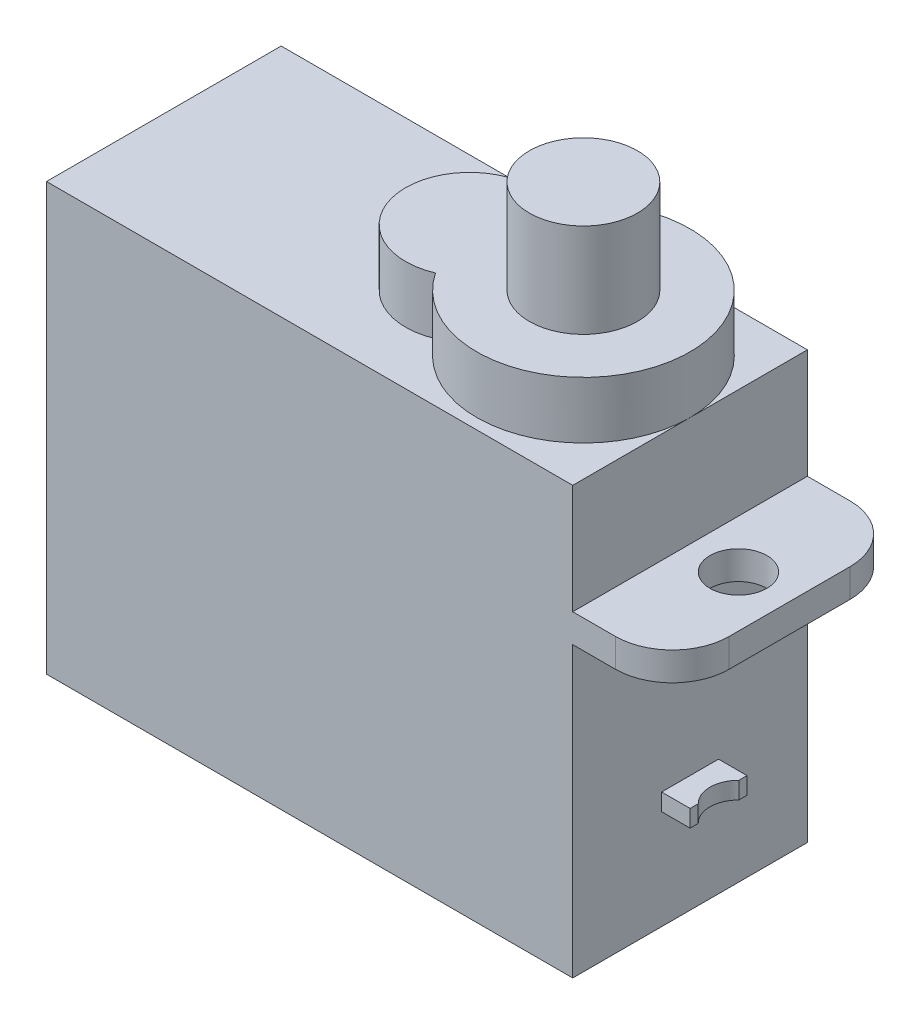
ISO-10303-21;
HEADER;
FILE_DESCRIPTION(('STEP AP214'),'2;1');
FILE_NAME('part.step','',(''),(''),'','','');
FILE_SCHEMA(('AUTOMOTIVE_DESIGN { 1 0 10303 214 1 1 1 1 }'));
ENDSEC;
DATA;
#1=APPLICATION_CONTEXT('core data for automotive mechanical design processes');
#2=APPLICATION_PROTOCOL_DEFINITION('international standard','automotive_design',2000,#1);
#3=PRODUCT_CONTEXT('',#1,'mechanical');
#4=PRODUCT('Part','Part','',(#3));
#5=PRODUCT_RELATED_PRODUCT_CATEGORY('part','',(#4));
#6=PRODUCT_DEFINITION_FORMATION('','',#4);
#7=PRODUCT_DEFINITION_CONTEXT('part definition',#1,'design');
#8=PRODUCT_DEFINITION('design','',#6,#7);
#9=PRODUCT_DEFINITION_SHAPE('','',#8);
#10=(LENGTH_UNIT() NAMED_UNIT(*) SI_UNIT(.MILLI.,.METRE.));
#11=(NAMED_UNIT(*) PLANE_ANGLE_UNIT() SI_UNIT($,.RADIAN.));
#12=(NAMED_UNIT(*) SI_UNIT($,.STERADIAN.) SOLID_ANGLE_UNIT());
#13=UNCERTAINTY_MEASURE_WITH_UNIT(LENGTH_MEASURE(1.E-05),#10,'distance_accuracy_value','');
#14=(GEOMETRIC_REPRESENTATION_CONTEXT(3) GLOBAL_UNCERTAINTY_ASSIGNED_CONTEXT((#13)) GLOBAL_UNIT_ASSIGNED_CONTEXT((#10,
#11,#12)) REPRESENTATION_CONTEXT('',''));
#15=CARTESIAN_POINT('',(0.,0.,0.));
#16=DIRECTION('',(0.,0.,1.));
#17=DIRECTION('',(1.,0.,0.));
#18=AXIS2_PLACEMENT_3D('',#15,#16,#17);
#19=CARTESIAN_POINT('',(10.25,0.,0.));
#20=DIRECTION('',(1.,0.,0.));
#21=DIRECTION('',(0.,0.,-1.));
#22=AXIS2_PLACEMENT_3D('',#19,#20,#21);
#23=PLANE('',#22);
#24=DIRECTION('',(0.,1.,0.));
#25=VECTOR('',#24,1.);
#26=CARTESIAN_POINT('',(10.25,0.,-0.714142842854284));
#27=LINE('',#26,#25);
#28=CARTESIAN_POINT('',(10.25,3.5,-0.714142842854284));
#29=VERTEX_POINT('',#28);
#30=CARTESIAN_POINT('',(10.25,4.1,-0.714142842854284));
#31=VERTEX_POINT('',#30);
#32=EDGE_CURVE('E190',#29,#31,#27,.T.);
#33=ORIENTED_EDGE('',*,*,#32,.F.);
#34=DIRECTION('',(0.,0.,-1.));
#35=VECTOR('',#34,1.);
#36=CARTESIAN_POINT('',(10.25,3.5,-1.));
#37=LINE('',#36,#35);
#38=CARTESIAN_POINT('',(10.25,3.5,-1.));
#39=VERTEX_POINT('',#38);
#40=EDGE_CURVE('E188',#29,#39,#37,.T.);
#41=ORIENTED_EDGE('',*,*,#40,.T.);
#42=DIRECTION('',(0.,1.,0.));
#43=VECTOR('',#42,1.);
#44=CARTESIAN_POINT('',(10.25,3.5,-1.));
#45=LINE('',#44,#43);
#46=CARTESIAN_POINT('',(10.25,4.1,-1.));
#47=VERTEX_POINT('',#46);
#48=EDGE_CURVE('E197',#39,#47,#45,.T.);
#49=ORIENTED_EDGE('',*,*,#48,.T.);
#50=DIRECTION('',(0.,0.,1.));
#51=VECTOR('',#50,1.);
#52=CARTESIAN_POINT('',(10.25,4.1,-1.));
#53=LINE('',#52,#51);
#54=EDGE_CURVE('E206',#47,#31,#53,.T.);
#55=ORIENTED_EDGE('',*,*,#54,.T.);
#56=EDGE_LOOP('',(#33,#41,#49,#55));
#57=FACE_BOUND('',#56,.T.);
#58=ADVANCED_FACE('F38',(#57),#23,.T.);
#59=CARTESIAN_POINT('',(9.25,15.,4.125));
#60=DIRECTION('',(-1.,0.,0.));
#61=DIRECTION('',(0.,0.,1.));
#62=AXIS2_PLACEMENT_3D('',#59,#60,#61);
#63=PLANE('',#62);
#64=DIRECTION('',(0.,-1.,0.));
#65=VECTOR('',#64,1.);
#66=CARTESIAN_POINT('',(9.25,3.5,1.));
#67=LINE('',#66,#65);
#68=CARTESIAN_POINT('',(9.25,4.1,1.));
#69=VERTEX_POINT('',#68);
#70=CARTESIAN_POINT('',(9.25,3.5,1.));
#71=VERTEX_POINT('',#70);
#72=EDGE_CURVE('E211',#69,#71,#67,.T.);
#73=ORIENTED_EDGE('',*,*,#72,.F.);
#74=DIRECTION('',(0.,0.,1.));
#75=VECTOR('',#74,1.);
#76=CARTESIAN_POINT('',(9.25,4.1,-1.));
#77=LINE('',#76,#75);
#78=CARTESIAN_POINT('',(9.25,4.1,-1.));
#79=VERTEX_POINT('',#78);
#80=EDGE_CURVE('E224',#79,#69,#77,.T.);
#81=ORIENTED_EDGE('',*,*,#80,.F.);
#82=DIRECTION('',(0.,1.,0.));
#83=VECTOR('',#82,1.);
#84=CARTESIAN_POINT('',(9.25,3.5,-1.));
#85=LINE('',#84,#83);
#86=CARTESIAN_POINT('',(9.25,3.5,-1.));
#87=VERTEX_POINT('',#86);
#88=EDGE_CURVE('E220',#87,#79,#85,.T.);
#89=ORIENTED_EDGE('',*,*,#88,.F.);
#90=DIRECTION('',(0.,0.,-1.));
#91=VECTOR('',#90,1.);
#92=CARTESIAN_POINT('',(9.25,3.5,-1.));
#93=LINE('',#92,#91);
#94=EDGE_CURVE('E215',#71,#87,#93,.T.);
#95=ORIENTED_EDGE('',*,*,#94,.F.);
#96=EDGE_LOOP('',(#73,#81,#89,#95));
#97=FACE_BOUND('',#96,.T.);
#98=DIRECTION('',(0.,0.,-1.));
#99=VECTOR('',#98,1.);
#100=CARTESIAN_POINT('',(9.25,10.15,4.125));
#101=LINE('',#100,#99);
#102=CARTESIAN_POINT('',(9.25,10.15,4.125));
#103=VERTEX_POINT('',#102);
#104=CARTESIAN_POINT('',(9.25,10.15,-4.125));
#105=VERTEX_POINT('',#104);
#106=EDGE_CURVE('E357',#103,#105,#101,.T.);
#107=ORIENTED_EDGE('',*,*,#106,.F.);
#108=DIRECTION('',(0.,-1.,0.));
#109=VECTOR('',#108,1.);
#110=CARTESIAN_POINT('',(9.25,15.,4.125));
#111=LINE('',#110,#109);
#112=CARTESIAN_POINT('',(9.25,0.,4.125));
#113=VERTEX_POINT('',#112);
#114=EDGE_CURVE('E313',#103,#113,#111,.T.);
#115=ORIENTED_EDGE('',*,*,#114,.T.);
#116=DIRECTION('',(0.,0.,-1.));
#117=VECTOR('',#116,1.);
#118=CARTESIAN_POINT('',(9.25,0.,4.125));
#119=LINE('',#118,#117);
#120=CARTESIAN_POINT('',(9.25,0.,-4.125));
#121=VERTEX_POINT('',#120);
#122=EDGE_CURVE('E299',#113,#121,#119,.T.);
#123=ORIENTED_EDGE('',*,*,#122,.T.);
#124=DIRECTION('',(0.,-1.,0.));
#125=VECTOR('',#124,1.);
#126=CARTESIAN_POINT('',(9.25,15.,-4.125));
#127=LINE('',#126,#125);
#128=EDGE_CURVE('E308',#105,#121,#127,.T.);
#129=ORIENTED_EDGE('',*,*,#128,.F.);
#130=EDGE_LOOP('',(#107,#115,#123,#129));
#131=FACE_BOUND('',#130,.T.);
#132=ADVANCED_FACE('F414',(#97,#131),#63,.F.);
#133=CARTESIAN_POINT('',(9.25,15.,4.125));
#134=VERTEX_POINT('',#133);
#135=CARTESIAN_POINT('',(9.25,11.15,4.125));
#136=VERTEX_POINT('',#135);
#137=EDGE_CURVE('E314',#134,#136,#111,.T.);
#138=ORIENTED_EDGE('',*,*,#137,.T.);
#139=DIRECTION('',(0.,0.,-1.));
#140=VECTOR('',#139,1.);
#141=CARTESIAN_POINT('',(9.25,11.15,4.125));
#142=LINE('',#141,#140);
#143=CARTESIAN_POINT('',(9.25,11.15,-4.125));
#144=VERTEX_POINT('',#143);
#145=EDGE_CURVE('E216',#136,#144,#142,.T.);
#146=ORIENTED_EDGE('',*,*,#145,.T.);
#147=CARTESIAN_POINT('',(9.25,15.,-4.125));
#148=VERTEX_POINT('',#147);
#149=EDGE_CURVE('E309',#148,#144,#127,.T.);
#150=ORIENTED_EDGE('',*,*,#149,.F.);
#151=DIRECTION('',(0.,0.,-1.));
#152=VECTOR('',#151,1.);
#153=CARTESIAN_POINT('',(9.25,15.,4.125));
#154=LINE('',#153,#152);
#155=CARTESIAN_POINT('',(9.24999999999999,15.,0.));
#156=VERTEX_POINT('',#155);
#157=EDGE_CURVE('E283',#156,#148,#154,.T.);
#158=ORIENTED_EDGE('',*,*,#157,.F.);
#159=EDGE_CURVE('E284',#134,#156,#154,.T.);
#160=ORIENTED_EDGE('',*,*,#159,.F.);
#161=EDGE_LOOP('',(#138,#146,#150,#158,#160));
#162=FACE_BOUND('',#161,.T.);
#163=ADVANCED_FACE('F380',(#162),#63,.F.);
#164=CARTESIAN_POINT('',(5.49999999999999,17.,0.));
#165=DIRECTION('',(0.,-1.,0.));
#166=DIRECTION('',(0.,0.,-1.));
#167=AXIS2_PLACEMENT_3D('',#164,#165,#166);
#168=CYLINDRICAL_SURFACE('',#167,3.75);
#169=DIRECTION('',(0.,-1.,0.));
#170=VECTOR('',#169,1.);
#171=CARTESIAN_POINT('',(2.37499999999999,16.,-2.07289049397213));
#172=LINE('',#171,#170);
#173=CARTESIAN_POINT('',(2.37499999999999,17.,-2.07289049397212));
#174=VERTEX_POINT('',#173);
#175=CARTESIAN_POINT('',(2.37499999999999,15.,-2.07289049397212));
#176=VERTEX_POINT('',#175);
#177=EDGE_CURVE('E262',#174,#176,#172,.T.);
#178=ORIENTED_EDGE('',*,*,#177,.F.);
#179=CARTESIAN_POINT('',(5.49999999999999,17.,0.));
#180=DIRECTION('',(0.,1.,0.));
#181=DIRECTION('',(0.,0.,1.));
#182=AXIS2_PLACEMENT_3D('',#179,#180,#181);
#183=CIRCLE('',#182,3.75);
#184=CARTESIAN_POINT('',(2.37499999999999,17.,2.07289049397212));
#185=VERTEX_POINT('',#184);
#186=EDGE_CURVE('E266',#185,#174,#183,.T.);
#187=ORIENTED_EDGE('',*,*,#186,.F.);
#188=DIRECTION('',(0.,-1.,0.));
#189=VECTOR('',#188,1.);
#190=CARTESIAN_POINT('',(2.37499999999999,16.,2.07289049397213));
#191=LINE('',#190,#189);
#192=CARTESIAN_POINT('',(2.37499999999999,15.,2.07289049397212));
#193=VERTEX_POINT('',#192);
#194=EDGE_CURVE('E256',#193,#185,#191,.F.);
#195=ORIENTED_EDGE('',*,*,#194,.F.);
#196=CARTESIAN_POINT('',(5.49999999999999,15.,0.));
#197=DIRECTION('',(0.,1.,0.));
#198=DIRECTION('',(0.,0.,1.));
#199=AXIS2_PLACEMENT_3D('',#196,#197,#198);
#200=CIRCLE('',#199,3.75);
#201=EDGE_CURVE('E265',#193,#156,#200,.T.);
#202=ORIENTED_EDGE('',*,*,#201,.T.);
#203=EDGE_CURVE('E271',#156,#176,#200,.T.);
#204=ORIENTED_EDGE('',*,*,#203,.T.);
#205=EDGE_LOOP('',(#178,#187,#195,#202,#204));
#206=FACE_BOUND('',#205,.T.);
#207=ADVANCED_FACE('F453',(#206),#168,.T.);
#208=CARTESIAN_POINT('',(-9.25,15.,4.125));
#209=DIRECTION('',(1.,0.,0.));
#210=DIRECTION('',(0.,0.,-1.));
#211=AXIS2_PLACEMENT_3D('',#208,#209,#210);
#212=PLANE('',#211);
#213=DIRECTION('',(0.,-1.,0.));
#214=VECTOR('',#213,1.);
#215=CARTESIAN_POINT('',(-9.25,15.,-4.125));
#216=LINE('',#215,#214);
#217=CARTESIAN_POINT('',(-9.25,15.,-4.125));
#218=VERTEX_POINT('',#217);
#219=CARTESIAN_POINT('',(-9.25,0.,-4.125));
#220=VERTEX_POINT('',#219);
#221=EDGE_CURVE('E291',#218,#220,#216,.T.);
#222=ORIENTED_EDGE('',*,*,#221,.T.);
#223=DIRECTION('',(0.,0.,1.));
#224=VECTOR('',#223,1.);
#225=CARTESIAN_POINT('',(-9.25,0.,4.125));
#226=LINE('',#225,#224);
#227=CARTESIAN_POINT('',(-9.25,0.,4.125));
#228=VERTEX_POINT('',#227);
#229=EDGE_CURVE('E270',#220,#228,#226,.T.);
#230=ORIENTED_EDGE('',*,*,#229,.T.);
#231=DIRECTION('',(0.,-1.,0.));
#232=VECTOR('',#231,1.);
#233=CARTESIAN_POINT('',(-9.25,15.,4.125));
#234=LINE('',#233,#232);
#235=CARTESIAN_POINT('',(-9.25,15.,4.125));
#236=VERTEX_POINT('',#235);
#237=EDGE_CURVE('E252',#236,#228,#234,.T.);
#238=ORIENTED_EDGE('',*,*,#237,.F.);
#239=DIRECTION('',(0.,0.,1.));
#240=VECTOR('',#239,1.);
#241=CARTESIAN_POINT('',(-9.25,15.,4.125));
#242=LINE('',#241,#240);
#243=EDGE_CURVE('E275',#218,#236,#242,.T.);
#244=ORIENTED_EDGE('',*,*,#243,.F.);
#245=EDGE_LOOP('',(#222,#230,#238,#244));
#246=FACE_BOUND('',#245,.T.);
#247=ADVANCED_FACE('F456',(#246),#212,.F.);
#248=CARTESIAN_POINT('',(9.25,15.,4.125));
#249=DIRECTION('',(0.,0.,-1.));
#250=DIRECTION('',(-1.,0.,0.));
#251=AXIS2_PLACEMENT_3D('',#248,#249,#250);
#252=PLANE('',#251);
#253=ORIENTED_EDGE('',*,*,#237,.T.);
#254=DIRECTION('',(1.,0.,0.));
#255=VECTOR('',#254,1.);
#256=CARTESIAN_POINT('',(9.25,0.,4.125));
#257=LINE('',#256,#255);
#258=EDGE_CURVE('E295',#228,#113,#257,.T.);
#259=ORIENTED_EDGE('',*,*,#258,.T.);
#260=ORIENTED_EDGE('',*,*,#114,.F.);
#261=DIRECTION('',(1.,0.,0.));
#262=VECTOR('',#261,1.);
#263=CARTESIAN_POINT('',(12.75,10.15,4.125));
#264=LINE('',#263,#262);
#265=CARTESIAN_POINT('',(10.75,10.15,4.125));
#266=VERTEX_POINT('',#265);
#267=EDGE_CURVE('E369',#103,#266,#264,.T.);
#268=ORIENTED_EDGE('',*,*,#267,.T.);
#269=DIRECTION('',(0.,-1.,0.));
#270=VECTOR('',#269,1.);
#271=CARTESIAN_POINT('',(10.75,15.,4.125));
#272=LINE('',#271,#270);
#273=CARTESIAN_POINT('',(10.75,11.15,4.125));
#274=VERTEX_POINT('',#273);
#275=EDGE_CURVE('E11',#266,#274,#272,.F.);
#276=ORIENTED_EDGE('',*,*,#275,.T.);
#277=DIRECTION('',(1.,0.,0.));
#278=VECTOR('',#277,1.);
#279=CARTESIAN_POINT('',(12.75,11.15,4.125));
#280=LINE('',#279,#278);
#281=EDGE_CURVE('E373',#136,#274,#280,.T.);
#282=ORIENTED_EDGE('',*,*,#281,.F.);
#283=ORIENTED_EDGE('',*,*,#137,.F.);
#284=DIRECTION('',(1.,0.,0.));
#285=VECTOR('',#284,1.);
#286=CARTESIAN_POINT('',(9.25,15.,4.125));
#287=LINE('',#286,#285);
#288=EDGE_CURVE('E279',#236,#134,#287,.T.);
#289=ORIENTED_EDGE('',*,*,#288,.F.);
#290=EDGE_LOOP('',(#253,#259,#260,#268,#276,#282,#283,#289));
#291=FACE_BOUND('',#290,.T.);
#292=ADVANCED_FACE('F385',(#291),#252,.F.);
#293=CARTESIAN_POINT('',(9.25,15.,-4.125));
#294=DIRECTION('',(0.,0.,1.));
#295=DIRECTION('',(1.,0.,0.));
#296=AXIS2_PLACEMENT_3D('',#293,#294,#295);
#297=PLANE('',#296);
#298=DIRECTION('',(-1.,0.,0.));
#299=VECTOR('',#298,1.);
#300=CARTESIAN_POINT('',(9.25,0.,-4.125));
#301=LINE('',#300,#299);
#302=EDGE_CURVE('E280',#121,#220,#301,.T.);
#303=ORIENTED_EDGE('',*,*,#302,.T.);
#304=ORIENTED_EDGE('',*,*,#221,.F.);
#305=DIRECTION('',(-1.,0.,0.));
#306=VECTOR('',#305,1.);
#307=CARTESIAN_POINT('',(9.25,15.,-4.125));
#308=LINE('',#307,#306);
#309=EDGE_CURVE('E288',#148,#218,#308,.T.);
#310=ORIENTED_EDGE('',*,*,#309,.F.);
#311=ORIENTED_EDGE('',*,*,#149,.T.);
#312=DIRECTION('',(-1.,0.,0.));
#313=VECTOR('',#312,1.);
#314=CARTESIAN_POINT('',(12.75,11.15,-4.125));
#315=LINE('',#314,#313);
#316=CARTESIAN_POINT('',(10.75,11.15,-4.125));
#317=VERTEX_POINT('',#316);
#318=EDGE_CURVE('E346',#317,#144,#315,.T.);
#319=ORIENTED_EDGE('',*,*,#318,.F.);
#320=DIRECTION('',(0.,-1.,0.));
#321=VECTOR('',#320,1.);
#322=CARTESIAN_POINT('',(10.75,15.,-4.125));
#323=LINE('',#322,#321);
#324=CARTESIAN_POINT('',(10.75,10.15,-4.125));
#325=VERTEX_POINT('',#324);
#326=EDGE_CURVE('E251',#317,#325,#323,.T.);
#327=ORIENTED_EDGE('',*,*,#326,.T.);
#328=DIRECTION('',(-1.,0.,0.));
#329=VECTOR('',#328,1.);
#330=CARTESIAN_POINT('',(12.75,10.15,-4.125));
#331=LINE('',#330,#329);
#332=EDGE_CURVE('E365',#325,#105,#331,.T.);
#333=ORIENTED_EDGE('',*,*,#332,.T.);
#334=ORIENTED_EDGE('',*,*,#128,.T.);
#335=EDGE_LOOP('',(#303,#304,#310,#311,#319,#327,#333,#334));
#336=FACE_BOUND('',#335,.T.);
#337=ADVANCED_FACE('F352',(#336),#297,.F.);
#338=CARTESIAN_POINT('',(0.,15.,0.));
#339=DIRECTION('',(0.,1.,0.));
#340=DIRECTION('',(0.,0.,1.));
#341=AXIS2_PLACEMENT_3D('',#338,#339,#340);
#342=PLANE('',#341);
#343=ORIENTED_EDGE('',*,*,#201,.F.);
#344=CARTESIAN_POINT('',(1.49999999999999,15.,0.));
#345=DIRECTION('',(0.,1.,0.));
#346=DIRECTION('',(0.,0.,1.));
#347=AXIS2_PLACEMENT_3D('',#344,#345,#346);
#348=CIRCLE('',#347,2.25);
#349=EDGE_CURVE('E246',#176,#193,#348,.T.);
#350=ORIENTED_EDGE('',*,*,#349,.F.);
#351=ORIENTED_EDGE('',*,*,#203,.F.);
#352=ORIENTED_EDGE('',*,*,#157,.T.);
#353=ORIENTED_EDGE('',*,*,#309,.T.);
#354=ORIENTED_EDGE('',*,*,#243,.T.);
#355=ORIENTED_EDGE('',*,*,#288,.T.);
#356=ORIENTED_EDGE('',*,*,#159,.T.);
#357=EDGE_LOOP('',(#343,#350,#351,#352,#353,#354,#355,#356));
#358=FACE_BOUND('',#357,.T.);
#359=ADVANCED_FACE('F458',(#358),#342,.T.);
#360=CARTESIAN_POINT('',(0.,0.,0.));
#361=DIRECTION('',(0.,1.,0.));
#362=DIRECTION('',(0.,0.,1.));
#363=AXIS2_PLACEMENT_3D('',#360,#361,#362);
#364=PLANE('',#363);
#365=ORIENTED_EDGE('',*,*,#229,.F.);
#366=ORIENTED_EDGE('',*,*,#302,.F.);
#367=ORIENTED_EDGE('',*,*,#122,.F.);
#368=ORIENTED_EDGE('',*,*,#258,.F.);
#369=EDGE_LOOP('',(#365,#366,#367,#368));
#370=FACE_BOUND('',#369,.T.);
#371=ADVANCED_FACE('F451',(#370),#364,.F.);
#372=CARTESIAN_POINT('',(5.49999999999999,17.,0.));
#373=DIRECTION('',(0.,1.,0.));
#374=DIRECTION('',(0.,0.,1.));
#375=AXIS2_PLACEMENT_3D('',#372,#373,#374);
#376=PLANE('',#375);
#377=CARTESIAN_POINT('',(5.49999999999999,17.,0.));
#378=DIRECTION('',(0.,1.,0.));
#379=DIRECTION('',(0.,0.,1.));
#380=AXIS2_PLACEMENT_3D('',#377,#378,#379);
#381=CIRCLE('',#380,1.9);
#382=CARTESIAN_POINT('',(5.49999999999999,17.,1.9));
#383=VERTEX_POINT('',#382);
#384=EDGE_CURVE('E247',#383,#383,#381,.T.);
#385=ORIENTED_EDGE('',*,*,#384,.F.);
#386=EDGE_LOOP('',(#385));
#387=FACE_BOUND('',#386,.T.);
#388=ORIENTED_EDGE('',*,*,#186,.T.);
#389=CARTESIAN_POINT('',(1.49999999999999,17.,0.));
#390=DIRECTION('',(0.,1.,0.));
#391=DIRECTION('',(0.,0.,1.));
#392=AXIS2_PLACEMENT_3D('',#389,#390,#391);
#393=CIRCLE('',#392,2.25);
#394=EDGE_CURVE('E253',#174,#185,#393,.T.);
#395=ORIENTED_EDGE('',*,*,#394,.T.);
#396=EDGE_LOOP('',(#388,#395));
#397=FACE_BOUND('',#396,.T.);
#398=ADVANCED_FACE('F447',(#387,#397),#376,.T.);
#399=CARTESIAN_POINT('',(1.49999999999999,17.,0.));
#400=DIRECTION('',(0.,-1.,0.));
#401=DIRECTION('',(0.,0.,-1.));
#402=AXIS2_PLACEMENT_3D('',#399,#400,#401);
#403=CYLINDRICAL_SURFACE('',#402,2.25);
#404=ORIENTED_EDGE('',*,*,#394,.F.);
#405=ORIENTED_EDGE('',*,*,#177,.T.);
#406=ORIENTED_EDGE('',*,*,#349,.T.);
#407=ORIENTED_EDGE('',*,*,#194,.T.);
#408=EDGE_LOOP('',(#404,#405,#406,#407));
#409=FACE_BOUND('',#408,.T.);
#410=ADVANCED_FACE('F443',(#409),#403,.T.);
#411=CARTESIAN_POINT('',(5.49999999999999,20.3,0.));
#412=DIRECTION('',(0.,-1.,0.));
#413=DIRECTION('',(0.,0.,-1.));
#414=AXIS2_PLACEMENT_3D('',#411,#412,#413);
#415=CYLINDRICAL_SURFACE('',#414,1.9);
#416=CARTESIAN_POINT('',(5.49999999999999,20.3,0.));
#417=DIRECTION('',(0.,1.,0.));
#418=DIRECTION('',(0.,0.,1.));
#419=AXIS2_PLACEMENT_3D('',#416,#417,#418);
#420=CIRCLE('',#419,1.9);
#421=CARTESIAN_POINT('',(5.49999999999999,20.3,1.9));
#422=VERTEX_POINT('',#421);
#423=EDGE_CURVE('E242',#422,#422,#420,.T.);
#424=ORIENTED_EDGE('',*,*,#423,.F.);
#425=EDGE_LOOP('',(#424));
#426=FACE_BOUND('',#425,.T.);
#427=ORIENTED_EDGE('',*,*,#384,.T.);
#428=EDGE_LOOP('',(#427));
#429=FACE_BOUND('',#428,.T.);
#430=ADVANCED_FACE('F439',(#426,#429),#415,.T.);
#431=CARTESIAN_POINT('',(5.49999999999999,20.3,0.));
#432=DIRECTION('',(0.,1.,0.));
#433=DIRECTION('',(0.,0.,1.));
#434=AXIS2_PLACEMENT_3D('',#431,#432,#433);
#435=PLANE('',#434);
#436=ORIENTED_EDGE('',*,*,#423,.T.);
#437=EDGE_LOOP('',(#436));
#438=FACE_BOUND('',#437,.T.);
#439=ADVANCED_FACE('F435',(#438),#435,.T.);
#440=CARTESIAN_POINT('',(10.25,3.5,1.));
#441=DIRECTION('',(0.,0.,-1.));
#442=DIRECTION('',(-1.,0.,0.));
#443=AXIS2_PLACEMENT_3D('',#440,#441,#442);
#444=PLANE('',#443);
#445=ORIENTED_EDGE('',*,*,#72,.T.);
#446=DIRECTION('',(-1.,0.,0.));
#447=VECTOR('',#446,1.);
#448=CARTESIAN_POINT('',(10.25,3.5,1.));
#449=LINE('',#448,#447);
#450=CARTESIAN_POINT('',(10.25,3.5,1.));
#451=VERTEX_POINT('',#450);
#452=EDGE_CURVE('E239',#451,#71,#449,.T.);
#453=ORIENTED_EDGE('',*,*,#452,.F.);
#454=DIRECTION('',(0.,-1.,0.));
#455=VECTOR('',#454,1.);
#456=CARTESIAN_POINT('',(10.25,3.5,1.));
#457=LINE('',#456,#455);
#458=CARTESIAN_POINT('',(10.25,4.1,1.));
#459=VERTEX_POINT('',#458);
#460=EDGE_CURVE('E194',#459,#451,#457,.T.);
#461=ORIENTED_EDGE('',*,*,#460,.F.);
#462=DIRECTION('',(-1.,0.,0.));
#463=VECTOR('',#462,1.);
#464=CARTESIAN_POINT('',(10.25,4.1,1.));
#465=LINE('',#464,#463);
#466=EDGE_CURVE('E210',#459,#69,#465,.T.);
#467=ORIENTED_EDGE('',*,*,#466,.T.);
#468=EDGE_LOOP('',(#445,#453,#461,#467));
#469=FACE_BOUND('',#468,.T.);
#470=ADVANCED_FACE('F432',(#469),#444,.F.);
#471=CARTESIAN_POINT('',(10.25,3.5,-1.));
#472=DIRECTION('',(0.,1.,0.));
#473=DIRECTION('',(0.,0.,1.));
#474=AXIS2_PLACEMENT_3D('',#471,#472,#473);
#475=PLANE('',#474);
#476=ORIENTED_EDGE('',*,*,#40,.F.);
#477=CARTESIAN_POINT('',(10.95,3.5,0.));
#478=DIRECTION('',(0.,1.,0.));
#479=DIRECTION('',(0.,0.,1.));
#480=AXIS2_PLACEMENT_3D('',#477,#478,#479);
#481=CIRCLE('',#480,1.);
#482=CARTESIAN_POINT('',(10.25,3.5,0.714142842854278));
#483=VERTEX_POINT('',#482);
#484=EDGE_CURVE('E171',#29,#483,#481,.T.);
#485=ORIENTED_EDGE('',*,*,#484,.T.);
#486=EDGE_CURVE('E185',#451,#483,#37,.T.);
#487=ORIENTED_EDGE('',*,*,#486,.F.);
#488=ORIENTED_EDGE('',*,*,#452,.T.);
#489=ORIENTED_EDGE('',*,*,#94,.T.);
#490=DIRECTION('',(-1.,0.,0.));
#491=VECTOR('',#490,1.);
#492=CARTESIAN_POINT('',(10.25,3.5,-1.));
#493=LINE('',#492,#491);
#494=EDGE_CURVE('E235',#39,#87,#493,.T.);
#495=ORIENTED_EDGE('',*,*,#494,.F.);
#496=EDGE_LOOP('',(#476,#485,#487,#488,#489,#495));
#497=FACE_BOUND('',#496,.T.);
#498=ADVANCED_FACE('F183',(#497),#475,.F.);
#499=CARTESIAN_POINT('',(10.25,3.5,-1.));
#500=DIRECTION('',(0.,0.,1.));
#501=DIRECTION('',(1.,0.,0.));
#502=AXIS2_PLACEMENT_3D('',#499,#500,#501);
#503=PLANE('',#502);
#504=ORIENTED_EDGE('',*,*,#88,.T.);
#505=DIRECTION('',(-1.,0.,0.));
#506=VECTOR('',#505,1.);
#507=CARTESIAN_POINT('',(10.25,4.1,-1.));
#508=LINE('',#507,#506);
#509=EDGE_CURVE('E231',#47,#79,#508,.T.);
#510=ORIENTED_EDGE('',*,*,#509,.F.);
#511=ORIENTED_EDGE('',*,*,#48,.F.);
#512=ORIENTED_EDGE('',*,*,#494,.T.);
#513=EDGE_LOOP('',(#504,#510,#511,#512));
#514=FACE_BOUND('',#513,.T.);
#515=ADVANCED_FACE('F425',(#514),#503,.F.);
#516=CARTESIAN_POINT('',(10.25,4.1,-1.));
#517=DIRECTION('',(0.,-1.,0.));
#518=DIRECTION('',(0.,0.,-1.));
#519=AXIS2_PLACEMENT_3D('',#516,#517,#518);
#520=PLANE('',#519);
#521=CARTESIAN_POINT('',(10.25,4.1,0.714142842854278));
#522=VERTEX_POINT('',#521);
#523=EDGE_CURVE('E201',#522,#459,#53,.T.);
#524=ORIENTED_EDGE('',*,*,#523,.F.);
#525=CARTESIAN_POINT('',(10.95,4.1,0.));
#526=DIRECTION('',(0.,-1.,0.));
#527=DIRECTION('',(0.,0.,-1.));
#528=AXIS2_PLACEMENT_3D('',#525,#526,#527);
#529=CIRCLE('',#528,1.);
#530=EDGE_CURVE('E174',#522,#31,#529,.T.);
#531=ORIENTED_EDGE('',*,*,#530,.T.);
#532=ORIENTED_EDGE('',*,*,#54,.F.);
#533=ORIENTED_EDGE('',*,*,#509,.T.);
#534=ORIENTED_EDGE('',*,*,#80,.T.);
#535=ORIENTED_EDGE('',*,*,#466,.F.);
#536=EDGE_LOOP('',(#524,#531,#532,#533,#534,#535));
#537=FACE_BOUND('',#536,.T.);
#538=ADVANCED_FACE('F410',(#537),#520,.F.);
#539=DIRECTION('',(0.,1.,0.));
#540=VECTOR('',#539,1.);
#541=CARTESIAN_POINT('',(10.25,0.,0.714142842854278));
#542=LINE('',#541,#540);
#543=EDGE_CURVE('E168',#522,#483,#542,.F.);
#544=ORIENTED_EDGE('',*,*,#543,.F.);
#545=ORIENTED_EDGE('',*,*,#523,.T.);
#546=ORIENTED_EDGE('',*,*,#460,.T.);
#547=ORIENTED_EDGE('',*,*,#486,.T.);
#548=EDGE_LOOP('',(#544,#545,#546,#547));
#549=FACE_BOUND('',#548,.T.);
#550=ADVANCED_FACE('F192',(#549),#23,.T.);
#551=CARTESIAN_POINT('',(0.,11.15,0.));
#552=DIRECTION('',(0.,1.,0.));
#553=DIRECTION('',(0.,0.,1.));
#554=AXIS2_PLACEMENT_3D('',#551,#552,#553);
#555=PLANE('',#554);
#556=CARTESIAN_POINT('',(10.95,11.15,0.));
#557=DIRECTION('',(0.,1.,0.));
#558=DIRECTION('',(0.,0.,-1.));
#559=AXIS2_PLACEMENT_3D('',#556,#557,#558);
#560=CIRCLE('',#559,1.);
#561=CARTESIAN_POINT('',(10.95,11.15,-1.));
#562=VERTEX_POINT('',#561);
#563=EDGE_CURVE('E322',#562,#562,#560,.T.);
#564=ORIENTED_EDGE('',*,*,#563,.F.);
#565=EDGE_LOOP('',(#564));
#566=FACE_BOUND('',#565,.T.);
#567=DIRECTION('',(0.,0.,-1.));
#568=VECTOR('',#567,1.);
#569=CARTESIAN_POINT('',(12.75,11.15,4.125));
#570=LINE('',#569,#568);
#571=CARTESIAN_POINT('',(12.75,11.15,2.125));
#572=VERTEX_POINT('',#571);
#573=CARTESIAN_POINT('',(12.75,11.15,-2.125));
#574=VERTEX_POINT('',#573);
#575=EDGE_CURVE('E348',#572,#574,#570,.T.);
#576=ORIENTED_EDGE('',*,*,#575,.T.);
#577=CARTESIAN_POINT('',(10.75,11.15,-2.125));
#578=DIRECTION('',(0.,1.,0.));
#579=DIRECTION('',(0.,0.,1.));
#580=AXIS2_PLACEMENT_3D('',#577,#578,#579);
#581=CIRCLE('',#580,2.);
#582=EDGE_CURVE('E47',#574,#317,#581,.T.);
#583=ORIENTED_EDGE('',*,*,#582,.T.);
#584=ORIENTED_EDGE('',*,*,#318,.T.);
#585=ORIENTED_EDGE('',*,*,#145,.F.);
#586=ORIENTED_EDGE('',*,*,#281,.T.);
#587=CARTESIAN_POINT('',(10.75,11.15,2.125));
#588=DIRECTION('',(0.,1.,0.));
#589=DIRECTION('',(0.,0.,1.));
#590=AXIS2_PLACEMENT_3D('',#587,#588,#589);
#591=CIRCLE('',#590,2.);
#592=EDGE_CURVE('E338',#274,#572,#591,.T.);
#593=ORIENTED_EDGE('',*,*,#592,.T.);
#594=EDGE_LOOP('',(#576,#583,#584,#585,#586,#593));
#595=FACE_BOUND('',#594,.T.);
#596=ADVANCED_FACE('F344',(#566,#595),#555,.T.);
#597=CARTESIAN_POINT('',(0.,10.15,0.));
#598=DIRECTION('',(0.,1.,0.));
#599=DIRECTION('',(0.,0.,1.));
#600=AXIS2_PLACEMENT_3D('',#597,#598,#599);
#601=PLANE('',#600);
#602=CARTESIAN_POINT('',(10.95,10.15,0.));
#603=DIRECTION('',(0.,1.,0.));
#604=DIRECTION('',(0.,0.,1.));
#605=AXIS2_PLACEMENT_3D('',#602,#603,#604);
#606=CIRCLE('',#605,1.);
#607=CARTESIAN_POINT('',(10.95,10.15,0.999999999999999));
#608=VERTEX_POINT('',#607);
#609=EDGE_CURVE('E179',#608,#608,#606,.T.);
#610=ORIENTED_EDGE('',*,*,#609,.T.);
#611=EDGE_LOOP('',(#610));
#612=FACE_BOUND('',#611,.T.);
#613=ORIENTED_EDGE('',*,*,#332,.F.);
#614=CARTESIAN_POINT('',(10.75,10.15,-2.125));
#615=DIRECTION('',(0.,1.,0.));
#616=DIRECTION('',(0.,0.,1.));
#617=AXIS2_PLACEMENT_3D('',#614,#615,#616);
#618=CIRCLE('',#617,2.);
#619=CARTESIAN_POINT('',(12.75,10.15,-2.125));
#620=VERTEX_POINT('',#619);
#621=EDGE_CURVE('E329',#325,#620,#618,.F.);
#622=ORIENTED_EDGE('',*,*,#621,.T.);
#623=DIRECTION('',(0.,0.,-1.));
#624=VECTOR('',#623,1.);
#625=CARTESIAN_POINT('',(12.75,10.15,4.125));
#626=LINE('',#625,#624);
#627=CARTESIAN_POINT('',(12.75,10.15,2.125));
#628=VERTEX_POINT('',#627);
#629=EDGE_CURVE('E363',#628,#620,#626,.T.);
#630=ORIENTED_EDGE('',*,*,#629,.F.);
#631=CARTESIAN_POINT('',(10.75,10.15,2.125));
#632=DIRECTION('',(0.,1.,0.));
#633=DIRECTION('',(0.,0.,1.));
#634=AXIS2_PLACEMENT_3D('',#631,#632,#633);
#635=CIRCLE('',#634,2.);
#636=EDGE_CURVE('E326',#628,#266,#635,.F.);
#637=ORIENTED_EDGE('',*,*,#636,.T.);
#638=ORIENTED_EDGE('',*,*,#267,.F.);
#639=ORIENTED_EDGE('',*,*,#106,.T.);
#640=EDGE_LOOP('',(#613,#622,#630,#637,#638,#639));
#641=FACE_BOUND('',#640,.T.);
#642=ADVANCED_FACE('F362',(#612,#641),#601,.F.);
#643=CARTESIAN_POINT('',(12.75,11.15,4.125));
#644=DIRECTION('',(-1.,0.,0.));
#645=DIRECTION('',(0.,0.,1.));
#646=AXIS2_PLACEMENT_3D('',#643,#644,#645);
#647=PLANE('',#646);
#648=ORIENTED_EDGE('',*,*,#629,.T.);
#649=DIRECTION('',(0.,-1.,0.));
#650=VECTOR('',#649,1.);
#651=CARTESIAN_POINT('',(12.75,11.15,-2.125));
#652=LINE('',#651,#650);
#653=EDGE_CURVE('E60',#620,#574,#652,.F.);
#654=ORIENTED_EDGE('',*,*,#653,.T.);
#655=ORIENTED_EDGE('',*,*,#575,.F.);
#656=DIRECTION('',(0.,-1.,0.));
#657=VECTOR('',#656,1.);
#658=CARTESIAN_POINT('',(12.75,11.15,2.125));
#659=LINE('',#658,#657);
#660=EDGE_CURVE('E332',#572,#628,#659,.T.);
#661=ORIENTED_EDGE('',*,*,#660,.T.);
#662=EDGE_LOOP('',(#648,#654,#655,#661));
#663=FACE_BOUND('',#662,.T.);
#664=ADVANCED_FACE('F366',(#663),#647,.F.);
#665=CARTESIAN_POINT('',(10.95,0.,0.));
#666=DIRECTION('',(0.,1.,0.));
#667=DIRECTION('',(0.,0.,1.));
#668=AXIS2_PLACEMENT_3D('',#665,#666,#667);
#669=CYLINDRICAL_SURFACE('',#668,1.);
#670=ORIENTED_EDGE('',*,*,#563,.T.);
#671=EDGE_LOOP('',(#670));
#672=FACE_BOUND('',#671,.T.);
#673=ORIENTED_EDGE('',*,*,#609,.F.);
#674=EDGE_LOOP('',(#673));
#675=FACE_BOUND('',#674,.T.);
#676=ADVANCED_FACE('F399',(#672,#675),#669,.F.);
#677=ORIENTED_EDGE('',*,*,#32,.T.);
#678=ORIENTED_EDGE('',*,*,#530,.F.);
#679=ORIENTED_EDGE('',*,*,#543,.T.);
#680=ORIENTED_EDGE('',*,*,#484,.F.);
#681=EDGE_LOOP('',(#677,#678,#679,#680));
#682=FACE_BOUND('',#681,.T.);
#683=ADVANCED_FACE('F170',(#682),#669,.F.);
#684=CARTESIAN_POINT('',(10.75,15.,-2.125));
#685=DIRECTION('',(0.,-1.,0.));
#686=DIRECTION('',(0.,0.,-1.));
#687=AXIS2_PLACEMENT_3D('',#684,#685,#686);
#688=CYLINDRICAL_SURFACE('',#687,2.);
#689=ORIENTED_EDGE('',*,*,#582,.F.);
#690=ORIENTED_EDGE('',*,*,#653,.F.);
#691=ORIENTED_EDGE('',*,*,#621,.F.);
#692=ORIENTED_EDGE('',*,*,#326,.F.);
#693=EDGE_LOOP('',(#689,#690,#691,#692));
#694=FACE_BOUND('',#693,.T.);
#695=ADVANCED_FACE('F359',(#694),#688,.T.);
#696=CARTESIAN_POINT('',(10.75,11.15,2.125));
#697=DIRECTION('',(0.,-1.,0.));
#698=DIRECTION('',(0.,0.,-1.));
#699=AXIS2_PLACEMENT_3D('',#696,#697,#698);
#700=CYLINDRICAL_SURFACE('',#699,2.);
#701=ORIENTED_EDGE('',*,*,#592,.F.);
#702=ORIENTED_EDGE('',*,*,#275,.F.);
#703=ORIENTED_EDGE('',*,*,#636,.F.);
#704=ORIENTED_EDGE('',*,*,#660,.F.);
#705=EDGE_LOOP('',(#701,#702,#703,#704));
#706=FACE_BOUND('',#705,.T.);
#707=ADVANCED_FACE('F40',(#706),#700,.T.);
#708=CLOSED_SHELL('',(#58,#132,#163,#207,#247,#292,#337,#359,#371,#398,#410,#430,#439,#470,#498,
#515,#538,#550,#596,#642,#664,#676,#683,#695,#707));
#709=MANIFOLD_SOLID_BREP('B2',#708);
#710=ADVANCED_BREP_SHAPE_REPRESENTATION('',(#18,#709),#14);
#711=SHAPE_DEFINITION_REPRESENTATION(#9,#710);
ENDSEC;
END-ISO-10303-21;
